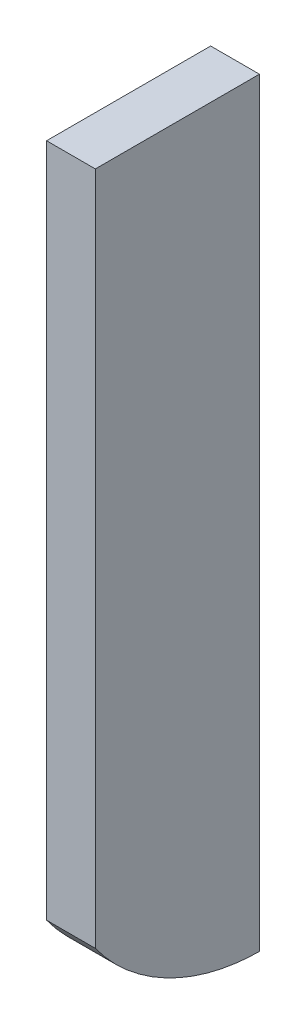
ISO-10303-21;
HEADER;
FILE_DESCRIPTION(('STEP AP214'),'2;1');
FILE_NAME('part.step','',(''),(''),'','','');
FILE_SCHEMA(('AUTOMOTIVE_DESIGN { 1 0 10303 214 1 1 1 1 }'));
ENDSEC;
DATA;
#1=APPLICATION_CONTEXT('core data for automotive mechanical design processes');
#2=APPLICATION_PROTOCOL_DEFINITION('international standard','automotive_design',2000,#1);
#3=PRODUCT_CONTEXT('',#1,'mechanical');
#4=PRODUCT('Part','Part','',(#3));
#5=PRODUCT_RELATED_PRODUCT_CATEGORY('part','',(#4));
#6=PRODUCT_DEFINITION_FORMATION('','',#4);
#7=PRODUCT_DEFINITION_CONTEXT('part definition',#1,'design');
#8=PRODUCT_DEFINITION('design','',#6,#7);
#9=PRODUCT_DEFINITION_SHAPE('','',#8);
#10=(LENGTH_UNIT() NAMED_UNIT(*) SI_UNIT(.MILLI.,.METRE.));
#11=(NAMED_UNIT(*) PLANE_ANGLE_UNIT() SI_UNIT($,.RADIAN.));
#12=(NAMED_UNIT(*) SI_UNIT($,.STERADIAN.) SOLID_ANGLE_UNIT());
#13=UNCERTAINTY_MEASURE_WITH_UNIT(LENGTH_MEASURE(1.E-05),#10,'distance_accuracy_value','');
#14=(GEOMETRIC_REPRESENTATION_CONTEXT(3) GLOBAL_UNCERTAINTY_ASSIGNED_CONTEXT((#13)) GLOBAL_UNIT_ASSIGNED_CONTEXT((#10,
#11,#12)) REPRESENTATION_CONTEXT('',''));
#15=CARTESIAN_POINT('',(0.,0.,0.));
#16=DIRECTION('',(0.,0.,1.));
#17=DIRECTION('',(1.,0.,0.));
#18=AXIS2_PLACEMENT_3D('',#15,#16,#17);
#19=CARTESIAN_POINT('',(130.275545119305,8.89509446053117,141.124949495809));
#20=CARTESIAN_POINT('',(130.275545120612,7.76007608868291,140.352625755421));
#21=CARTESIAN_POINT('',(130.275545122937,7.0623410570695,138.979099908697));
#22=CARTESIAN_POINT('',(130.27554512528,7.11523884317805,137.59467206288));
#23=B_SPLINE_CURVE_WITH_KNOTS('',3,(#19,#20,#21,#22),.UNSPECIFIED.,.F.,.F.,(4,4),(0.,
1.12963036894798),.UNSPECIFIED.);
#24=DIRECTION('',(1.,0.,1.69244514382854E-09));
#25=VECTOR('',#24,1.);
#26=SURFACE_OF_LINEAR_EXTRUSION('',#23,#25);
#27=CARTESIAN_POINT('',(131.258630216318,8.89509446053117,141.124949497473));
#28=CARTESIAN_POINT('',(131.258630217625,7.76007608868291,140.352625757085));
#29=CARTESIAN_POINT('',(131.25863021995,7.0623410570695,138.979099910361));
#30=CARTESIAN_POINT('',(131.258630222293,7.11523884317805,137.594672064544));
#31=B_SPLINE_CURVE_WITH_KNOTS('',3,(#27,#28,#29,#30),.UNSPECIFIED.,.F.,.F.,(4,4),(0.,
1.12963036894798),.UNSPECIFIED.);
#32=CARTESIAN_POINT('',(131.258630216408,8.81879422782466,141.071657472263));
#33=VERTEX_POINT('',#32);
#34=CARTESIAN_POINT('',(131.258630221997,7.11252475672268,137.76928087795));
#35=VERTEX_POINT('',#34);
#36=EDGE_CURVE('E101',#33,#35,#31,.T.);
#37=ORIENTED_EDGE('',*,*,#36,.F.);
#38=DIRECTION('',(1.,0.,1.69244514382854E-09));
#39=VECTOR('',#38,1.);
#40=CARTESIAN_POINT('',(130.275545119395,8.81879422782466,141.071657470599));
#41=LINE('',#40,#39);
#42=CARTESIAN_POINT('',(130.275545119395,8.81879422782466,141.071657470599));
#43=VERTEX_POINT('',#42);
#44=EDGE_CURVE('E33',#43,#33,#41,.T.);
#45=ORIENTED_EDGE('',*,*,#44,.F.);
#46=CARTESIAN_POINT('',(130.275545124984,7.11252475672268,137.769280876286));
#47=VERTEX_POINT('',#46);
#48=EDGE_CURVE('E120',#43,#47,#23,.T.);
#49=ORIENTED_EDGE('',*,*,#48,.T.);
#50=DIRECTION('',(1.,0.,1.69244514382854E-09));
#51=VECTOR('',#50,1.);
#52=CARTESIAN_POINT('',(130.275545124984,7.11252475672268,137.769280876286));
#53=LINE('',#52,#51);
#54=EDGE_CURVE('E10',#47,#35,#53,.T.);
#55=ORIENTED_EDGE('',*,*,#54,.T.);
#56=EDGE_LOOP('',(#37,#45,#49,#55));
#57=FACE_BOUND('',#56,.T.);
#58=ADVANCED_FACE('F16',(#57),#26,.T.);
#59=CARTESIAN_POINT('',(130.275545124731,7.2695446829004,137.919057617473));
#60=DIRECTION('',(-1.22465209118163E-09,-0.69022031181875,0.723599282167159));
#61=DIRECTION('',(0.,-0.723599282167159,-0.69022031181875));
#62=AXIS2_PLACEMENT_3D('',#59,#60,#61);
#63=PLANE('',#62);
#64=DIRECTION('',(1.16816081274581E-09,-0.723599282167159,-0.69022031181875));
#65=VECTOR('',#64,1.);
#66=CARTESIAN_POINT('',(131.258630221744,7.2695446829004,137.919057619136));
#67=LINE('',#66,#65);
#68=CARTESIAN_POINT('',(131.258630222003,7.10922214723298,137.766130614803));
#69=VERTEX_POINT('',#68);
#70=EDGE_CURVE('E106',#35,#69,#67,.T.);
#71=ORIENTED_EDGE('',*,*,#70,.F.);
#72=ORIENTED_EDGE('',*,*,#54,.F.);
#73=DIRECTION('',(1.16816081274581E-09,-0.723599282167159,-0.69022031181875));
#74=VECTOR('',#73,1.);
#75=CARTESIAN_POINT('',(130.275545124731,7.2695446829004,137.919057617473));
#76=LINE('',#75,#74);
#77=CARTESIAN_POINT('',(130.27554512499,7.10922214723298,137.766130613139));
#78=VERTEX_POINT('',#77);
#79=EDGE_CURVE('E125',#47,#78,#76,.T.);
#80=ORIENTED_EDGE('',*,*,#79,.T.);
#81=DIRECTION('',(1.,0.,1.69244514382854E-09));
#82=VECTOR('',#81,1.);
#83=CARTESIAN_POINT('',(130.27554512499,7.10922214723298,137.766130613139));
#84=LINE('',#83,#82);
#85=EDGE_CURVE('E25',#78,#69,#84,.T.);
#86=ORIENTED_EDGE('',*,*,#85,.T.);
#87=EDGE_LOOP('',(#71,#72,#80,#86));
#88=FACE_BOUND('',#87,.T.);
#89=ADVANCED_FACE('F124',(#88),#63,.T.);
#90=CARTESIAN_POINT('',(130.27554512499,7.10922214723298,137.766130613139));
#91=DIRECTION('',(1.69244514382854E-09,0.,-1.));
#92=DIRECTION('',(-1.,0.,-1.69244514382854E-09));
#93=AXIS2_PLACEMENT_3D('',#90,#91,#92);
#94=PLANE('',#93);
#95=DIRECTION('',(0.,1.,0.));
#96=VECTOR('',#95,1.);
#97=CARTESIAN_POINT('',(131.258630222003,7.10922214723298,137.766130614803));
#98=LINE('',#97,#96);
#99=CARTESIAN_POINT('',(131.258630222003,22.4180272452805,137.766130606342));
#100=VERTEX_POINT('',#99);
#101=EDGE_CURVE('E112',#69,#100,#98,.T.);
#102=ORIENTED_EDGE('',*,*,#101,.F.);
#103=ORIENTED_EDGE('',*,*,#85,.F.);
#104=DIRECTION('',(0.,1.,0.));
#105=VECTOR('',#104,1.);
#106=CARTESIAN_POINT('',(130.27554512499,7.10922214723298,137.766130613139));
#107=LINE('',#106,#105);
#108=CARTESIAN_POINT('',(130.27554512499,22.4180272452805,137.766130604678));
#109=VERTEX_POINT('',#108);
#110=EDGE_CURVE('E92',#78,#109,#107,.T.);
#111=ORIENTED_EDGE('',*,*,#110,.T.);
#112=DIRECTION('',(1.,0.,1.69244514382854E-09));
#113=VECTOR('',#112,1.);
#114=CARTESIAN_POINT('',(130.27554512499,22.4180272452805,137.766130604678));
#115=LINE('',#114,#113);
#116=EDGE_CURVE('E84',#109,#100,#115,.T.);
#117=ORIENTED_EDGE('',*,*,#116,.T.);
#118=EDGE_LOOP('',(#102,#103,#111,#117));
#119=FACE_BOUND('',#118,.T.);
#120=ADVANCED_FACE('F127',(#119),#94,.T.);
#121=CARTESIAN_POINT('',(130.27554512499,22.4180272452805,137.766130604678));
#122=DIRECTION('',(0.,1.,0.));
#123=DIRECTION('',(-1.,0.,0.));
#124=AXIS2_PLACEMENT_3D('',#121,#122,#123);
#125=PLANE('',#124);
#126=DIRECTION('',(-1.69244514382854E-09,0.,1.));
#127=VECTOR('',#126,1.);
#128=CARTESIAN_POINT('',(131.258630222003,22.4180272452805,137.766130606342));
#129=LINE('',#128,#127);
#130=CARTESIAN_POINT('',(131.258630216408,22.4180272452805,141.07198462347));
#131=VERTEX_POINT('',#130);
#132=EDGE_CURVE('E115',#100,#131,#129,.T.);
#133=ORIENTED_EDGE('',*,*,#132,.F.);
#134=ORIENTED_EDGE('',*,*,#116,.F.);
#135=DIRECTION('',(-1.69244514382854E-09,0.,1.));
#136=VECTOR('',#135,1.);
#137=CARTESIAN_POINT('',(130.27554512499,22.4180272452805,137.766130604678));
#138=LINE('',#137,#136);
#139=CARTESIAN_POINT('',(130.275545119395,22.4180272452805,141.071984621806));
#140=VERTEX_POINT('',#139);
#141=EDGE_CURVE('E87',#109,#140,#138,.T.);
#142=ORIENTED_EDGE('',*,*,#141,.T.);
#143=DIRECTION('',(1.,0.,1.69244514382854E-09));
#144=VECTOR('',#143,1.);
#145=CARTESIAN_POINT('',(130.275545119395,22.4180272452805,141.071984621806));
#146=LINE('',#145,#144);
#147=EDGE_CURVE('E73',#140,#131,#146,.T.);
#148=ORIENTED_EDGE('',*,*,#147,.T.);
#149=EDGE_LOOP('',(#133,#134,#142,#148));
#150=FACE_BOUND('',#149,.T.);
#151=ADVANCED_FACE('F88',(#150),#125,.T.);
#152=CARTESIAN_POINT('',(130.275545119395,22.4180272452805,141.071984621806));
#153=DIRECTION('',(-1.69244514382854E-09,0.,1.));
#154=DIRECTION('',(1.,0.,1.69244514382854E-09));
#155=AXIS2_PLACEMENT_3D('',#152,#153,#154);
#156=PLANE('',#155);
#157=DIRECTION('',(0.,-1.,0.));
#158=VECTOR('',#157,1.);
#159=CARTESIAN_POINT('',(131.258630216408,22.4180272452805,141.07198462347));
#160=LINE('',#159,#158);
#161=CARTESIAN_POINT('',(131.258630216408,8.81868673554072,141.07198462347));
#162=VERTEX_POINT('',#161);
#163=EDGE_CURVE('E80',#131,#162,#160,.T.);
#164=ORIENTED_EDGE('',*,*,#163,.F.);
#165=ORIENTED_EDGE('',*,*,#147,.F.);
#166=DIRECTION('',(0.,-1.,0.));
#167=VECTOR('',#166,1.);
#168=CARTESIAN_POINT('',(130.275545119395,22.4180272452805,141.071984621806));
#169=LINE('',#168,#167);
#170=CARTESIAN_POINT('',(130.275545119395,8.81868673554072,141.071984621806));
#171=VERTEX_POINT('',#170);
#172=EDGE_CURVE('E77',#140,#171,#169,.T.);
#173=ORIENTED_EDGE('',*,*,#172,.T.);
#174=DIRECTION('',(1.,0.,1.69244514382854E-09));
#175=VECTOR('',#174,1.);
#176=CARTESIAN_POINT('',(130.275545119395,8.81868673554072,141.071984621806));
#177=LINE('',#176,#175);
#178=EDGE_CURVE('E55',#171,#162,#177,.T.);
#179=ORIENTED_EDGE('',*,*,#178,.T.);
#180=EDGE_LOOP('',(#164,#165,#173,#179));
#181=FACE_BOUND('',#180,.T.);
#182=ADVANCED_FACE('F75',(#181),#156,.T.);
#183=CARTESIAN_POINT('',(130.275545119395,8.81868673554072,141.071984621806));
#184=DIRECTION('',(5.28301184537688E-10,-0.950031969100034,-0.312152619223214));
#185=DIRECTION('',(0.,0.312152619223214,-0.950031969100034));
#186=AXIS2_PLACEMENT_3D('',#183,#184,#185);
#187=PLANE('',#186);
#188=DIRECTION('',(1.60787809074188E-09,0.312152619223214,-0.950031969100034));
#189=VECTOR('',#188,1.);
#190=CARTESIAN_POINT('',(131.258630216408,8.81868673554072,141.07198462347));
#191=LINE('',#190,#189);
#192=EDGE_CURVE('E118',#162,#33,#191,.T.);
#193=ORIENTED_EDGE('',*,*,#192,.F.);
#194=ORIENTED_EDGE('',*,*,#178,.F.);
#195=DIRECTION('',(1.60787809074188E-09,0.312152619223214,-0.950031969100034));
#196=VECTOR('',#195,1.);
#197=CARTESIAN_POINT('',(130.275545119395,8.81868673554072,141.071984621806));
#198=LINE('',#197,#196);
#199=EDGE_CURVE('E96',#171,#43,#198,.T.);
#200=ORIENTED_EDGE('',*,*,#199,.T.);
#201=ORIENTED_EDGE('',*,*,#44,.T.);
#202=EDGE_LOOP('',(#193,#194,#200,#201));
#203=FACE_BOUND('',#202,.T.);
#204=ADVANCED_FACE('F151',(#203),#187,.T.);
#205=CARTESIAN_POINT('',(130.275545201028,17.2651002409467,92.8378644340291));
#206=DIRECTION('',(1.,0.,1.69244514382854E-09));
#207=DIRECTION('',(0.,1.,0.));
#208=AXIS2_PLACEMENT_3D('',#205,#206,#207);
#209=PLANE('',#208);
#210=ORIENTED_EDGE('',*,*,#48,.F.);
#211=ORIENTED_EDGE('',*,*,#199,.F.);
#212=ORIENTED_EDGE('',*,*,#172,.F.);
#213=ORIENTED_EDGE('',*,*,#141,.F.);
#214=ORIENTED_EDGE('',*,*,#110,.F.);
#215=ORIENTED_EDGE('',*,*,#79,.F.);
#216=EDGE_LOOP('',(#210,#211,#212,#213,#214,#215));
#217=FACE_BOUND('',#216,.T.);
#218=ADVANCED_FACE('F95',(#217),#209,.F.);
#219=CARTESIAN_POINT('',(131.258630298041,17.2651002409467,92.8378644356929));
#220=DIRECTION('',(1.,0.,1.69244514382854E-09));
#221=DIRECTION('',(0.,1.,0.));
#222=AXIS2_PLACEMENT_3D('',#219,#220,#221);
#223=PLANE('',#222);
#224=ORIENTED_EDGE('',*,*,#36,.T.);
#225=ORIENTED_EDGE('',*,*,#70,.T.);
#226=ORIENTED_EDGE('',*,*,#101,.T.);
#227=ORIENTED_EDGE('',*,*,#132,.T.);
#228=ORIENTED_EDGE('',*,*,#163,.T.);
#229=ORIENTED_EDGE('',*,*,#192,.T.);
#230=EDGE_LOOP('',(#224,#225,#226,#227,#228,#229));
#231=FACE_BOUND('',#230,.T.);
#232=ADVANCED_FACE('F129',(#231),#223,.T.);
#233=CLOSED_SHELL('',(#58,#89,#120,#151,#182,#204,#218,#232));
#234=MANIFOLD_SOLID_BREP('B1',#233);
#235=ADVANCED_BREP_SHAPE_REPRESENTATION('',(#18,#234),#14);
#236=SHAPE_DEFINITION_REPRESENTATION(#9,#235);
ENDSEC;
END-ISO-10303-21;
